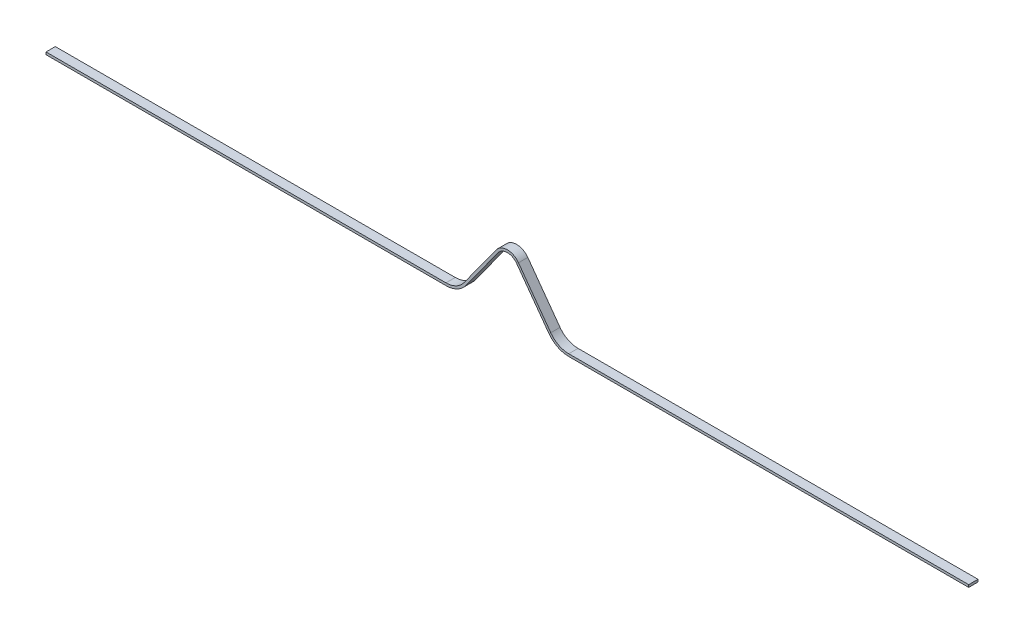
ISO-10303-21;
HEADER;
FILE_DESCRIPTION(('STEP AP214'),'2;1');
FILE_NAME('part.step','',(''),(''),'','','');
FILE_SCHEMA(('AUTOMOTIVE_DESIGN { 1 0 10303 214 1 1 1 1 }'));
ENDSEC;
DATA;
#1=APPLICATION_CONTEXT('core data for automotive mechanical design processes');
#2=APPLICATION_PROTOCOL_DEFINITION('international standard','automotive_design',2000,#1);
#3=PRODUCT_CONTEXT('',#1,'mechanical');
#4=PRODUCT('Part','Part','',(#3));
#5=PRODUCT_RELATED_PRODUCT_CATEGORY('part','',(#4));
#6=PRODUCT_DEFINITION_FORMATION('','',#4);
#7=PRODUCT_DEFINITION_CONTEXT('part definition',#1,'design');
#8=PRODUCT_DEFINITION('design','',#6,#7);
#9=PRODUCT_DEFINITION_SHAPE('','',#8);
#10=(LENGTH_UNIT() NAMED_UNIT(*) SI_UNIT(.MILLI.,.METRE.));
#11=(NAMED_UNIT(*) PLANE_ANGLE_UNIT() SI_UNIT($,.RADIAN.));
#12=(NAMED_UNIT(*) SI_UNIT($,.STERADIAN.) SOLID_ANGLE_UNIT());
#13=UNCERTAINTY_MEASURE_WITH_UNIT(LENGTH_MEASURE(1.E-05),#10,'distance_accuracy_value','');
#14=(GEOMETRIC_REPRESENTATION_CONTEXT(3) GLOBAL_UNCERTAINTY_ASSIGNED_CONTEXT((#13)) GLOBAL_UNIT_ASSIGNED_CONTEXT((#10,
#11,#12)) REPRESENTATION_CONTEXT('',''));
#15=CARTESIAN_POINT('',(0.,0.,0.));
#16=DIRECTION('',(0.,0.,1.));
#17=DIRECTION('',(1.,0.,0.));
#18=AXIS2_PLACEMENT_3D('',#15,#16,#17);
#19=CARTESIAN_POINT('',(248.,-25.7999999999999,2.5));
#20=DIRECTION('',(0.,1.,0.));
#21=DIRECTION('',(-1.,0.,0.));
#22=AXIS2_PLACEMENT_3D('',#19,#20,#21);
#23=PLANE('',#22);
#24=DIRECTION('',(1.,0.,0.));
#25=VECTOR('',#24,1.);
#26=CARTESIAN_POINT('',(248.,-25.7999999999999,-2.5));
#27=LINE('',#26,#25);
#28=CARTESIAN_POINT('',(33.,-25.8,-2.5));
#29=VERTEX_POINT('',#28);
#30=CARTESIAN_POINT('',(248.,-25.7999999999999,-2.5));
#31=VERTEX_POINT('',#30);
#32=EDGE_CURVE('E176',#29,#31,#27,.T.);
#33=ORIENTED_EDGE('',*,*,#32,.T.);
#34=DIRECTION('',(0.,0.,-1.));
#35=VECTOR('',#34,1.);
#36=CARTESIAN_POINT('',(248.,-25.7999999999999,2.5));
#37=LINE('',#36,#35);
#38=CARTESIAN_POINT('',(248.,-25.7999999999999,2.5));
#39=VERTEX_POINT('',#38);
#40=EDGE_CURVE('E11',#39,#31,#37,.T.);
#41=ORIENTED_EDGE('',*,*,#40,.F.);
#42=DIRECTION('',(1.,0.,0.));
#43=VECTOR('',#42,1.);
#44=CARTESIAN_POINT('',(248.,-25.7999999999999,2.5));
#45=LINE('',#44,#43);
#46=CARTESIAN_POINT('',(33.,-25.8,2.5));
#47=VERTEX_POINT('',#46);
#48=EDGE_CURVE('E113',#47,#39,#45,.T.);
#49=ORIENTED_EDGE('',*,*,#48,.F.);
#50=DIRECTION('',(0.,0.,-1.));
#51=VECTOR('',#50,1.);
#52=CARTESIAN_POINT('',(33.,-25.8,2.5));
#53=LINE('',#52,#51);
#54=EDGE_CURVE('E172',#47,#29,#53,.T.);
#55=ORIENTED_EDGE('',*,*,#54,.T.);
#56=EDGE_LOOP('',(#33,#41,#49,#55));
#57=FACE_BOUND('',#56,.T.);
#58=ADVANCED_FACE('F33',(#57),#23,.F.);
#59=CARTESIAN_POINT('',(248.,-24.4999999999999,2.5));
#60=DIRECTION('',(1.,0.,0.));
#61=DIRECTION('',(0.,0.,-1.));
#62=AXIS2_PLACEMENT_3D('',#59,#60,#61);
#63=PLANE('',#62);
#64=DIRECTION('',(0.,-1.,0.));
#65=VECTOR('',#64,1.);
#66=CARTESIAN_POINT('',(248.,-24.4999999999999,-2.5));
#67=LINE('',#66,#65);
#68=CARTESIAN_POINT('',(248.,-24.4999999999999,-2.5));
#69=VERTEX_POINT('',#68);
#70=EDGE_CURVE('E179',#69,#31,#67,.T.);
#71=ORIENTED_EDGE('',*,*,#70,.F.);
#72=DIRECTION('',(0.,0.,-1.));
#73=VECTOR('',#72,1.);
#74=CARTESIAN_POINT('',(248.,-24.4999999999999,2.5));
#75=LINE('',#74,#73);
#76=CARTESIAN_POINT('',(248.,-24.4999999999999,2.5));
#77=VERTEX_POINT('',#76);
#78=EDGE_CURVE('E41',#77,#69,#75,.T.);
#79=ORIENTED_EDGE('',*,*,#78,.F.);
#80=DIRECTION('',(0.,-1.,0.));
#81=VECTOR('',#80,1.);
#82=CARTESIAN_POINT('',(248.,-24.4999999999999,2.5));
#83=LINE('',#82,#81);
#84=EDGE_CURVE('E261',#77,#39,#83,.T.);
#85=ORIENTED_EDGE('',*,*,#84,.T.);
#86=ORIENTED_EDGE('',*,*,#40,.T.);
#87=EDGE_LOOP('',(#71,#79,#85,#86));
#88=FACE_BOUND('',#87,.T.);
#89=ADVANCED_FACE('F248',(#88),#63,.T.);
#90=CARTESIAN_POINT('',(248.,-24.4999999999999,2.5));
#91=DIRECTION('',(0.,1.,0.));
#92=DIRECTION('',(-1.,0.,0.));
#93=AXIS2_PLACEMENT_3D('',#90,#91,#92);
#94=PLANE('',#93);
#95=DIRECTION('',(1.,0.,0.));
#96=VECTOR('',#95,1.);
#97=CARTESIAN_POINT('',(248.,-24.4999999999999,-2.5));
#98=LINE('',#97,#96);
#99=CARTESIAN_POINT('',(33.,-24.5,-2.5));
#100=VERTEX_POINT('',#99);
#101=EDGE_CURVE('E182',#100,#69,#98,.T.);
#102=ORIENTED_EDGE('',*,*,#101,.F.);
#103=DIRECTION('',(0.,0.,-1.));
#104=VECTOR('',#103,1.);
#105=CARTESIAN_POINT('',(33.,-24.5,2.5));
#106=LINE('',#105,#104);
#107=CARTESIAN_POINT('',(33.,-24.5,2.5));
#108=VERTEX_POINT('',#107);
#109=EDGE_CURVE('E238',#108,#100,#106,.T.);
#110=ORIENTED_EDGE('',*,*,#109,.F.);
#111=DIRECTION('',(1.,0.,0.));
#112=VECTOR('',#111,1.);
#113=CARTESIAN_POINT('',(248.,-24.4999999999999,2.5));
#114=LINE('',#113,#112);
#115=EDGE_CURVE('E245',#108,#77,#114,.T.);
#116=ORIENTED_EDGE('',*,*,#115,.T.);
#117=ORIENTED_EDGE('',*,*,#78,.T.);
#118=EDGE_LOOP('',(#102,#110,#116,#117));
#119=FACE_BOUND('',#118,.T.);
#120=ADVANCED_FACE('F243',(#119),#94,.T.);
#121=CARTESIAN_POINT('',(33.,-12.55,2.5));
#122=DIRECTION('',(0.,0.,-1.));
#123=DIRECTION('',(-1.,0.,0.));
#124=AXIS2_PLACEMENT_3D('',#121,#122,#123);
#125=CYLINDRICAL_SURFACE('',#124,11.95);
#126=CARTESIAN_POINT('',(33.,-12.55,-2.5));
#127=DIRECTION('',(0.,0.,1.));
#128=DIRECTION('',(-1.,0.,0.));
#129=AXIS2_PLACEMENT_3D('',#126,#127,#128);
#130=CIRCLE('',#129,11.95);
#131=CARTESIAN_POINT('',(23.3253218533214,-19.5644923378801,-2.5));
#132=VERTEX_POINT('',#131);
#133=EDGE_CURVE('E185',#132,#100,#130,.T.);
#134=ORIENTED_EDGE('',*,*,#133,.F.);
#135=DIRECTION('',(0.,0.,-1.));
#136=VECTOR('',#135,1.);
#137=CARTESIAN_POINT('',(23.3253218533214,-19.5644923378801,2.5));
#138=LINE('',#137,#136);
#139=CARTESIAN_POINT('',(23.3253218533214,-19.5644923378801,2.5));
#140=VERTEX_POINT('',#139);
#141=EDGE_CURVE('E236',#140,#132,#138,.T.);
#142=ORIENTED_EDGE('',*,*,#141,.F.);
#143=CARTESIAN_POINT('',(33.,-12.55,2.5));
#144=DIRECTION('',(0.,0.,1.));
#145=DIRECTION('',(-1.,0.,0.));
#146=AXIS2_PLACEMENT_3D('',#143,#144,#145);
#147=CIRCLE('',#146,11.95);
#148=EDGE_CURVE('E258',#140,#108,#147,.T.);
#149=ORIENTED_EDGE('',*,*,#148,.T.);
#150=ORIENTED_EDGE('',*,*,#109,.T.);
#151=EDGE_LOOP('',(#134,#142,#149,#150));
#152=FACE_BOUND('',#151,.T.);
#153=ADVANCED_FACE('F255',(#152),#125,.F.);
#154=CARTESIAN_POINT('',(23.3253218533214,-19.5644923378801,2.5));
#155=DIRECTION('',(0.809596497630012,0.586986806517164,0.));
#156=DIRECTION('',(-0.586986806517164,0.809596497630012,0.));
#157=AXIS2_PLACEMENT_3D('',#154,#155,#156);
#158=PLANE('',#157);
#159=DIRECTION('',(0.586986806517164,-0.809596497630012,0.));
#160=VECTOR('',#159,1.);
#161=CARTESIAN_POINT('',(23.3253218533214,-19.5644923378801,-2.5));
#162=LINE('',#161,#160);
#163=CARTESIAN_POINT('',(5.99101408246208,4.34370236822701,-2.5));
#164=VERTEX_POINT('',#163);
#165=EDGE_CURVE('E188',#164,#132,#162,.T.);
#166=ORIENTED_EDGE('',*,*,#165,.F.);
#167=DIRECTION('',(0.,0.,-1.));
#168=VECTOR('',#167,1.);
#169=CARTESIAN_POINT('',(5.99101408246208,4.34370236822701,2.5));
#170=LINE('',#169,#168);
#171=CARTESIAN_POINT('',(5.99101408246208,4.34370236822701,2.5));
#172=VERTEX_POINT('',#171);
#173=EDGE_CURVE('E234',#172,#164,#170,.T.);
#174=ORIENTED_EDGE('',*,*,#173,.F.);
#175=DIRECTION('',(0.586986806517164,-0.809596497630012,0.));
#176=VECTOR('',#175,1.);
#177=CARTESIAN_POINT('',(23.3253218533214,-19.5644923378801,2.5));
#178=LINE('',#177,#176);
#179=EDGE_CURVE('E263',#172,#140,#178,.T.);
#180=ORIENTED_EDGE('',*,*,#179,.T.);
#181=ORIENTED_EDGE('',*,*,#141,.T.);
#182=EDGE_LOOP('',(#166,#174,#180,#181));
#183=FACE_BOUND('',#182,.T.);
#184=ADVANCED_FACE('F320',(#183),#158,.T.);
#185=CARTESIAN_POINT('',(0.,0.,2.5));
#186=DIRECTION('',(0.,0.,-1.));
#187=DIRECTION('',(-1.,0.,0.));
#188=AXIS2_PLACEMENT_3D('',#185,#186,#187);
#189=CYLINDRICAL_SURFACE('',#188,7.4);
#190=CARTESIAN_POINT('',(0.,0.,-2.5));
#191=DIRECTION('',(0.,0.,-1.));
#192=DIRECTION('',(1.,0.,0.));
#193=AXIS2_PLACEMENT_3D('',#190,#191,#192);
#194=CIRCLE('',#193,7.4);
#195=CARTESIAN_POINT('',(-5.99101408246209,4.343702368227,-2.5));
#196=VERTEX_POINT('',#195);
#197=EDGE_CURVE('E191',#196,#164,#194,.T.);
#198=ORIENTED_EDGE('',*,*,#197,.F.);
#199=DIRECTION('',(0.,0.,-1.));
#200=VECTOR('',#199,1.);
#201=CARTESIAN_POINT('',(-5.99101408246209,4.343702368227,2.5));
#202=LINE('',#201,#200);
#203=CARTESIAN_POINT('',(-5.99101408246209,4.343702368227,2.5));
#204=VERTEX_POINT('',#203);
#205=EDGE_CURVE('E232',#204,#196,#202,.T.);
#206=ORIENTED_EDGE('',*,*,#205,.F.);
#207=CARTESIAN_POINT('',(0.,0.,2.5));
#208=DIRECTION('',(0.,0.,-1.));
#209=DIRECTION('',(1.,0.,0.));
#210=AXIS2_PLACEMENT_3D('',#207,#208,#209);
#211=CIRCLE('',#210,7.4);
#212=EDGE_CURVE('E269',#204,#172,#211,.T.);
#213=ORIENTED_EDGE('',*,*,#212,.T.);
#214=ORIENTED_EDGE('',*,*,#173,.T.);
#215=EDGE_LOOP('',(#198,#206,#213,#214));
#216=FACE_BOUND('',#215,.T.);
#217=ADVANCED_FACE('F323',(#216),#189,.T.);
#218=CARTESIAN_POINT('',(-23.3253218533214,-19.5644923378801,2.5));
#219=DIRECTION('',(-0.809596497630012,0.586986806517164,0.));
#220=DIRECTION('',(-0.586986806517164,-0.809596497630012,0.));
#221=AXIS2_PLACEMENT_3D('',#218,#219,#220);
#222=PLANE('',#221);
#223=DIRECTION('',(0.586986806517164,0.809596497630012,0.));
#224=VECTOR('',#223,1.);
#225=CARTESIAN_POINT('',(-23.3253218533214,-19.5644923378801,-2.5));
#226=LINE('',#225,#224);
#227=CARTESIAN_POINT('',(-23.3253218533214,-19.5644923378801,-2.5));
#228=VERTEX_POINT('',#227);
#229=EDGE_CURVE('E194',#228,#196,#226,.T.);
#230=ORIENTED_EDGE('',*,*,#229,.F.);
#231=DIRECTION('',(0.,0.,-1.));
#232=VECTOR('',#231,1.);
#233=CARTESIAN_POINT('',(-23.3253218533214,-19.5644923378801,2.5));
#234=LINE('',#233,#232);
#235=CARTESIAN_POINT('',(-23.3253218533214,-19.5644923378801,2.5));
#236=VERTEX_POINT('',#235);
#237=EDGE_CURVE('E230',#236,#228,#234,.T.);
#238=ORIENTED_EDGE('',*,*,#237,.F.);
#239=DIRECTION('',(0.586986806517164,0.809596497630012,0.));
#240=VECTOR('',#239,1.);
#241=CARTESIAN_POINT('',(-23.3253218533214,-19.5644923378801,2.5));
#242=LINE('',#241,#240);
#243=EDGE_CURVE('E272',#236,#204,#242,.T.);
#244=ORIENTED_EDGE('',*,*,#243,.T.);
#245=ORIENTED_EDGE('',*,*,#205,.T.);
#246=EDGE_LOOP('',(#230,#238,#244,#245));
#247=FACE_BOUND('',#246,.T.);
#248=ADVANCED_FACE('F327',(#247),#222,.T.);
#249=CARTESIAN_POINT('',(-33.,-12.55,2.5));
#250=DIRECTION('',(0.,0.,-1.));
#251=DIRECTION('',(-1.,0.,0.));
#252=AXIS2_PLACEMENT_3D('',#249,#250,#251);
#253=CYLINDRICAL_SURFACE('',#252,11.95);
#254=CARTESIAN_POINT('',(-33.,-12.55,-2.5));
#255=DIRECTION('',(0.,0.,1.));
#256=DIRECTION('',(1.,0.,0.));
#257=AXIS2_PLACEMENT_3D('',#254,#255,#256);
#258=CIRCLE('',#257,11.95);
#259=CARTESIAN_POINT('',(-33.,-24.5,-2.5));
#260=VERTEX_POINT('',#259);
#261=EDGE_CURVE('E197',#260,#228,#258,.T.);
#262=ORIENTED_EDGE('',*,*,#261,.F.);
#263=DIRECTION('',(0.,0.,-1.));
#264=VECTOR('',#263,1.);
#265=CARTESIAN_POINT('',(-33.,-24.5,2.5));
#266=LINE('',#265,#264);
#267=CARTESIAN_POINT('',(-33.,-24.5,2.5));
#268=VERTEX_POINT('',#267);
#269=EDGE_CURVE('E228',#268,#260,#266,.T.);
#270=ORIENTED_EDGE('',*,*,#269,.F.);
#271=CARTESIAN_POINT('',(-33.,-12.55,2.5));
#272=DIRECTION('',(0.,0.,1.));
#273=DIRECTION('',(1.,0.,0.));
#274=AXIS2_PLACEMENT_3D('',#271,#272,#273);
#275=CIRCLE('',#274,11.95);
#276=EDGE_CURVE('E275',#268,#236,#275,.T.);
#277=ORIENTED_EDGE('',*,*,#276,.T.);
#278=ORIENTED_EDGE('',*,*,#237,.T.);
#279=EDGE_LOOP('',(#262,#270,#277,#278));
#280=FACE_BOUND('',#279,.T.);
#281=ADVANCED_FACE('F331',(#280),#253,.F.);
#282=CARTESIAN_POINT('',(-248.,-24.5,2.5));
#283=DIRECTION('',(0.,1.,0.));
#284=DIRECTION('',(-1.,0.,0.));
#285=AXIS2_PLACEMENT_3D('',#282,#283,#284);
#286=PLANE('',#285);
#287=DIRECTION('',(1.,0.,0.));
#288=VECTOR('',#287,1.);
#289=CARTESIAN_POINT('',(-248.,-24.5,-2.5));
#290=LINE('',#289,#288);
#291=CARTESIAN_POINT('',(-248.,-24.5,-2.5));
#292=VERTEX_POINT('',#291);
#293=EDGE_CURVE('E200',#292,#260,#290,.T.);
#294=ORIENTED_EDGE('',*,*,#293,.F.);
#295=DIRECTION('',(0.,0.,-1.));
#296=VECTOR('',#295,1.);
#297=CARTESIAN_POINT('',(-248.,-24.5,2.5));
#298=LINE('',#297,#296);
#299=CARTESIAN_POINT('',(-248.,-24.5,2.5));
#300=VERTEX_POINT('',#299);
#301=EDGE_CURVE('E226',#300,#292,#298,.T.);
#302=ORIENTED_EDGE('',*,*,#301,.F.);
#303=DIRECTION('',(1.,0.,0.));
#304=VECTOR('',#303,1.);
#305=CARTESIAN_POINT('',(-248.,-24.5,2.5));
#306=LINE('',#305,#304);
#307=EDGE_CURVE('E278',#300,#268,#306,.T.);
#308=ORIENTED_EDGE('',*,*,#307,.T.);
#309=ORIENTED_EDGE('',*,*,#269,.T.);
#310=EDGE_LOOP('',(#294,#302,#308,#309));
#311=FACE_BOUND('',#310,.T.);
#312=ADVANCED_FACE('F335',(#311),#286,.T.);
#313=CARTESIAN_POINT('',(-248.,-25.8,2.5));
#314=DIRECTION('',(-1.,0.,0.));
#315=DIRECTION('',(0.,0.,1.));
#316=AXIS2_PLACEMENT_3D('',#313,#314,#315);
#317=PLANE('',#316);
#318=DIRECTION('',(0.,1.,0.));
#319=VECTOR('',#318,1.);
#320=CARTESIAN_POINT('',(-248.,-25.8,-2.5));
#321=LINE('',#320,#319);
#322=CARTESIAN_POINT('',(-248.,-25.8,-2.5));
#323=VERTEX_POINT('',#322);
#324=EDGE_CURVE('E203',#323,#292,#321,.T.);
#325=ORIENTED_EDGE('',*,*,#324,.F.);
#326=DIRECTION('',(0.,0.,-1.));
#327=VECTOR('',#326,1.);
#328=CARTESIAN_POINT('',(-248.,-25.8,2.5));
#329=LINE('',#328,#327);
#330=CARTESIAN_POINT('',(-248.,-25.8,2.5));
#331=VERTEX_POINT('',#330);
#332=EDGE_CURVE('E224',#331,#323,#329,.T.);
#333=ORIENTED_EDGE('',*,*,#332,.F.);
#334=DIRECTION('',(0.,1.,0.));
#335=VECTOR('',#334,1.);
#336=CARTESIAN_POINT('',(-248.,-25.8,2.5));
#337=LINE('',#336,#335);
#338=EDGE_CURVE('E281',#331,#300,#337,.T.);
#339=ORIENTED_EDGE('',*,*,#338,.T.);
#340=ORIENTED_EDGE('',*,*,#301,.T.);
#341=EDGE_LOOP('',(#325,#333,#339,#340));
#342=FACE_BOUND('',#341,.T.);
#343=ADVANCED_FACE('F339',(#342),#317,.T.);
#344=CARTESIAN_POINT('',(-248.,-25.8,2.5));
#345=DIRECTION('',(0.,1.,0.));
#346=DIRECTION('',(-1.,0.,0.));
#347=AXIS2_PLACEMENT_3D('',#344,#345,#346);
#348=PLANE('',#347);
#349=DIRECTION('',(1.,0.,0.));
#350=VECTOR('',#349,1.);
#351=CARTESIAN_POINT('',(-248.,-25.8,-2.5));
#352=LINE('',#351,#350);
#353=CARTESIAN_POINT('',(-33.,-25.8,-2.5));
#354=VERTEX_POINT('',#353);
#355=EDGE_CURVE('E206',#323,#354,#352,.T.);
#356=ORIENTED_EDGE('',*,*,#355,.T.);
#357=DIRECTION('',(0.,0.,-1.));
#358=VECTOR('',#357,1.);
#359=CARTESIAN_POINT('',(-33.,-25.8,2.5));
#360=LINE('',#359,#358);
#361=CARTESIAN_POINT('',(-33.,-25.8,2.5));
#362=VERTEX_POINT('',#361);
#363=EDGE_CURVE('E221',#362,#354,#360,.T.);
#364=ORIENTED_EDGE('',*,*,#363,.F.);
#365=DIRECTION('',(1.,0.,0.));
#366=VECTOR('',#365,1.);
#367=CARTESIAN_POINT('',(-248.,-25.8,2.5));
#368=LINE('',#367,#366);
#369=EDGE_CURVE('E284',#331,#362,#368,.T.);
#370=ORIENTED_EDGE('',*,*,#369,.F.);
#371=ORIENTED_EDGE('',*,*,#332,.T.);
#372=EDGE_LOOP('',(#356,#364,#370,#371));
#373=FACE_BOUND('',#372,.T.);
#374=ADVANCED_FACE('F343',(#373),#348,.F.);
#375=CARTESIAN_POINT('',(-33.,-12.55,2.5));
#376=DIRECTION('',(0.,0.,-1.));
#377=DIRECTION('',(-1.,0.,0.));
#378=AXIS2_PLACEMENT_3D('',#375,#376,#377);
#379=CYLINDRICAL_SURFACE('',#378,13.25);
#380=CARTESIAN_POINT('',(-33.,-12.55,-2.5));
#381=DIRECTION('',(0.,0.,1.));
#382=DIRECTION('',(1.,0.,0.));
#383=AXIS2_PLACEMENT_3D('',#380,#381,#382);
#384=CIRCLE('',#383,13.25);
#385=CARTESIAN_POINT('',(-22.2728464064023,-20.3275751863524,-2.5));
#386=VERTEX_POINT('',#385);
#387=EDGE_CURVE('E208',#354,#386,#384,.T.);
#388=ORIENTED_EDGE('',*,*,#387,.T.);
#389=DIRECTION('',(0.,0.,-1.));
#390=VECTOR('',#389,1.);
#391=CARTESIAN_POINT('',(-22.2728464064023,-20.3275751863524,2.5));
#392=LINE('',#391,#390);
#393=CARTESIAN_POINT('',(-22.2728464064023,-20.3275751863524,2.5));
#394=VERTEX_POINT('',#393);
#395=EDGE_CURVE('E218',#394,#386,#392,.T.);
#396=ORIENTED_EDGE('',*,*,#395,.F.);
#397=CARTESIAN_POINT('',(-33.,-12.55,2.5));
#398=DIRECTION('',(0.,0.,1.));
#399=DIRECTION('',(1.,0.,0.));
#400=AXIS2_PLACEMENT_3D('',#397,#398,#399);
#401=CIRCLE('',#400,13.25);
#402=EDGE_CURVE('E286',#362,#394,#401,.T.);
#403=ORIENTED_EDGE('',*,*,#402,.F.);
#404=ORIENTED_EDGE('',*,*,#363,.T.);
#405=EDGE_LOOP('',(#388,#396,#403,#404));
#406=FACE_BOUND('',#405,.T.);
#407=ADVANCED_FACE('F293',(#406),#379,.T.);
#408=CARTESIAN_POINT('',(-22.2728464064023,-20.3275751863524,2.5));
#409=DIRECTION('',(-0.809596497630012,0.586986806517164,0.));
#410=DIRECTION('',(-0.586986806517164,-0.809596497630012,0.));
#411=AXIS2_PLACEMENT_3D('',#408,#409,#410);
#412=PLANE('',#411);
#413=DIRECTION('',(0.586986806517164,0.809596497630012,0.));
#414=VECTOR('',#413,1.);
#415=CARTESIAN_POINT('',(-22.2728464064023,-20.3275751863524,-2.5));
#416=LINE('',#415,#414);
#417=CARTESIAN_POINT('',(-4.93853863554307,3.58061951975469,-2.5));
#418=VERTEX_POINT('',#417);
#419=EDGE_CURVE('E210',#386,#418,#416,.T.);
#420=ORIENTED_EDGE('',*,*,#419,.T.);
#421=DIRECTION('',(0.,0.,-1.));
#422=VECTOR('',#421,1.);
#423=CARTESIAN_POINT('',(-4.93853863554307,3.58061951975469,2.5));
#424=LINE('',#423,#422);
#425=CARTESIAN_POINT('',(-4.93853863554307,3.58061951975469,2.5));
#426=VERTEX_POINT('',#425);
#427=EDGE_CURVE('E167',#426,#418,#424,.T.);
#428=ORIENTED_EDGE('',*,*,#427,.F.);
#429=DIRECTION('',(0.586986806517164,0.809596497630012,0.));
#430=VECTOR('',#429,1.);
#431=CARTESIAN_POINT('',(-22.2728464064023,-20.3275751863524,2.5));
#432=LINE('',#431,#430);
#433=EDGE_CURVE('E158',#394,#426,#432,.T.);
#434=ORIENTED_EDGE('',*,*,#433,.F.);
#435=ORIENTED_EDGE('',*,*,#395,.T.);
#436=EDGE_LOOP('',(#420,#428,#434,#435));
#437=FACE_BOUND('',#436,.T.);
#438=ADVANCED_FACE('F297',(#437),#412,.F.);
#439=CARTESIAN_POINT('',(0.,0.,2.5));
#440=DIRECTION('',(0.,0.,-1.));
#441=DIRECTION('',(-1.,0.,0.));
#442=AXIS2_PLACEMENT_3D('',#439,#440,#441);
#443=CYLINDRICAL_SURFACE('',#442,6.1);
#444=CARTESIAN_POINT('',(0.,0.,-2.5));
#445=DIRECTION('',(0.,0.,1.));
#446=DIRECTION('',(1.,0.,0.));
#447=AXIS2_PLACEMENT_3D('',#444,#445,#446);
#448=CIRCLE('',#447,6.1);
#449=CARTESIAN_POINT('',(4.93853863554307,3.5806195197547,-2.5));
#450=VERTEX_POINT('',#449);
#451=EDGE_CURVE('E166',#418,#450,#448,.F.);
#452=ORIENTED_EDGE('',*,*,#451,.T.);
#453=DIRECTION('',(0.,0.,-1.));
#454=VECTOR('',#453,1.);
#455=CARTESIAN_POINT('',(4.93853863554307,3.5806195197547,2.5));
#456=LINE('',#455,#454);
#457=CARTESIAN_POINT('',(4.93853863554307,3.5806195197547,2.5));
#458=VERTEX_POINT('',#457);
#459=EDGE_CURVE('E163',#458,#450,#456,.T.);
#460=ORIENTED_EDGE('',*,*,#459,.F.);
#461=CARTESIAN_POINT('',(0.,0.,2.5));
#462=DIRECTION('',(0.,0.,1.));
#463=DIRECTION('',(1.,0.,0.));
#464=AXIS2_PLACEMENT_3D('',#461,#462,#463);
#465=CIRCLE('',#464,6.1);
#466=EDGE_CURVE('E152',#426,#458,#465,.F.);
#467=ORIENTED_EDGE('',*,*,#466,.F.);
#468=ORIENTED_EDGE('',*,*,#427,.T.);
#469=EDGE_LOOP('',(#452,#460,#467,#468));
#470=FACE_BOUND('',#469,.T.);
#471=ADVANCED_FACE('F164',(#470),#443,.F.);
#472=CARTESIAN_POINT('',(22.2728464064023,-20.3275751863524,2.5));
#473=DIRECTION('',(0.809596497630012,0.586986806517164,0.));
#474=DIRECTION('',(-0.586986806517164,0.809596497630012,0.));
#475=AXIS2_PLACEMENT_3D('',#472,#473,#474);
#476=PLANE('',#475);
#477=DIRECTION('',(0.586986806517164,-0.809596497630012,0.));
#478=VECTOR('',#477,1.);
#479=CARTESIAN_POINT('',(22.2728464064023,-20.3275751863524,-2.5));
#480=LINE('',#479,#478);
#481=CARTESIAN_POINT('',(22.2728464064023,-20.3275751863524,-2.5));
#482=VERTEX_POINT('',#481);
#483=EDGE_CURVE('E101',#450,#482,#480,.T.);
#484=ORIENTED_EDGE('',*,*,#483,.T.);
#485=DIRECTION('',(0.,0.,-1.));
#486=VECTOR('',#485,1.);
#487=CARTESIAN_POINT('',(22.2728464064023,-20.3275751863524,2.5));
#488=LINE('',#487,#486);
#489=CARTESIAN_POINT('',(22.2728464064023,-20.3275751863524,2.5));
#490=VERTEX_POINT('',#489);
#491=EDGE_CURVE('E168',#490,#482,#488,.T.);
#492=ORIENTED_EDGE('',*,*,#491,.F.);
#493=DIRECTION('',(0.586986806517164,-0.809596497630012,0.));
#494=VECTOR('',#493,1.);
#495=CARTESIAN_POINT('',(22.2728464064023,-20.3275751863524,2.5));
#496=LINE('',#495,#494);
#497=EDGE_CURVE('E156',#458,#490,#496,.T.);
#498=ORIENTED_EDGE('',*,*,#497,.F.);
#499=ORIENTED_EDGE('',*,*,#459,.T.);
#500=EDGE_LOOP('',(#484,#492,#498,#499));
#501=FACE_BOUND('',#500,.T.);
#502=ADVANCED_FACE('F170',(#501),#476,.F.);
#503=CARTESIAN_POINT('',(33.,-12.55,2.5));
#504=DIRECTION('',(0.,0.,-1.));
#505=DIRECTION('',(-1.,0.,0.));
#506=AXIS2_PLACEMENT_3D('',#503,#504,#505);
#507=CYLINDRICAL_SURFACE('',#506,13.25);
#508=CARTESIAN_POINT('',(33.,-12.55,-2.5));
#509=DIRECTION('',(0.,0.,1.));
#510=DIRECTION('',(1.,0.,0.));
#511=AXIS2_PLACEMENT_3D('',#508,#509,#510);
#512=CIRCLE('',#511,13.25);
#513=EDGE_CURVE('E107',#482,#29,#512,.T.);
#514=ORIENTED_EDGE('',*,*,#513,.T.);
#515=ORIENTED_EDGE('',*,*,#54,.F.);
#516=CARTESIAN_POINT('',(33.,-12.55,2.5));
#517=DIRECTION('',(0.,0.,1.));
#518=DIRECTION('',(1.,0.,0.));
#519=AXIS2_PLACEMENT_3D('',#516,#517,#518);
#520=CIRCLE('',#519,13.25);
#521=EDGE_CURVE('E49',#490,#47,#520,.T.);
#522=ORIENTED_EDGE('',*,*,#521,.F.);
#523=ORIENTED_EDGE('',*,*,#491,.T.);
#524=EDGE_LOOP('',(#514,#515,#522,#523));
#525=FACE_BOUND('',#524,.T.);
#526=ADVANCED_FACE('F299',(#525),#507,.T.);
#527=CARTESIAN_POINT('',(33.,-12.55,2.5));
#528=DIRECTION('',(0.,0.,1.));
#529=DIRECTION('',(1.,0.,0.));
#530=AXIS2_PLACEMENT_3D('',#527,#528,#529);
#531=PLANE('',#530);
#532=ORIENTED_EDGE('',*,*,#48,.T.);
#533=ORIENTED_EDGE('',*,*,#84,.F.);
#534=ORIENTED_EDGE('',*,*,#115,.F.);
#535=ORIENTED_EDGE('',*,*,#148,.F.);
#536=ORIENTED_EDGE('',*,*,#179,.F.);
#537=ORIENTED_EDGE('',*,*,#212,.F.);
#538=ORIENTED_EDGE('',*,*,#243,.F.);
#539=ORIENTED_EDGE('',*,*,#276,.F.);
#540=ORIENTED_EDGE('',*,*,#307,.F.);
#541=ORIENTED_EDGE('',*,*,#338,.F.);
#542=ORIENTED_EDGE('',*,*,#369,.T.);
#543=ORIENTED_EDGE('',*,*,#402,.T.);
#544=ORIENTED_EDGE('',*,*,#433,.T.);
#545=ORIENTED_EDGE('',*,*,#466,.T.);
#546=ORIENTED_EDGE('',*,*,#497,.T.);
#547=ORIENTED_EDGE('',*,*,#521,.T.);
#548=EDGE_LOOP('',(#532,#533,#534,#535,#536,#537,#538,#539,#540,#541,#542,#543,#544,#545,#546,#547));
#549=FACE_BOUND('',#548,.T.);
#550=ADVANCED_FACE('F154',(#549),#531,.T.);
#551=CARTESIAN_POINT('',(33.,-12.55,-2.5));
#552=DIRECTION('',(0.,0.,1.));
#553=DIRECTION('',(1.,0.,0.));
#554=AXIS2_PLACEMENT_3D('',#551,#552,#553);
#555=PLANE('',#554);
#556=ORIENTED_EDGE('',*,*,#32,.F.);
#557=ORIENTED_EDGE('',*,*,#513,.F.);
#558=ORIENTED_EDGE('',*,*,#483,.F.);
#559=ORIENTED_EDGE('',*,*,#451,.F.);
#560=ORIENTED_EDGE('',*,*,#419,.F.);
#561=ORIENTED_EDGE('',*,*,#387,.F.);
#562=ORIENTED_EDGE('',*,*,#355,.F.);
#563=ORIENTED_EDGE('',*,*,#324,.T.);
#564=ORIENTED_EDGE('',*,*,#293,.T.);
#565=ORIENTED_EDGE('',*,*,#261,.T.);
#566=ORIENTED_EDGE('',*,*,#229,.T.);
#567=ORIENTED_EDGE('',*,*,#197,.T.);
#568=ORIENTED_EDGE('',*,*,#165,.T.);
#569=ORIENTED_EDGE('',*,*,#133,.T.);
#570=ORIENTED_EDGE('',*,*,#101,.T.);
#571=ORIENTED_EDGE('',*,*,#70,.T.);
#572=EDGE_LOOP('',(#556,#557,#558,#559,#560,#561,#562,#563,#564,#565,#566,#567,#568,#569,#570,#571));
#573=FACE_BOUND('',#572,.T.);
#574=ADVANCED_FACE('F251',(#573),#555,.F.);
#575=CLOSED_SHELL('',(#58,#89,#120,#153,#184,#217,#248,#281,#312,#343,#374,#407,#438,#471,#502,
#526,#550,#574));
#576=MANIFOLD_SOLID_BREP('B2',#575);
#577=ADVANCED_BREP_SHAPE_REPRESENTATION('',(#18,#576),#14);
#578=SHAPE_DEFINITION_REPRESENTATION(#9,#577);
ENDSEC;
END-ISO-10303-21;
